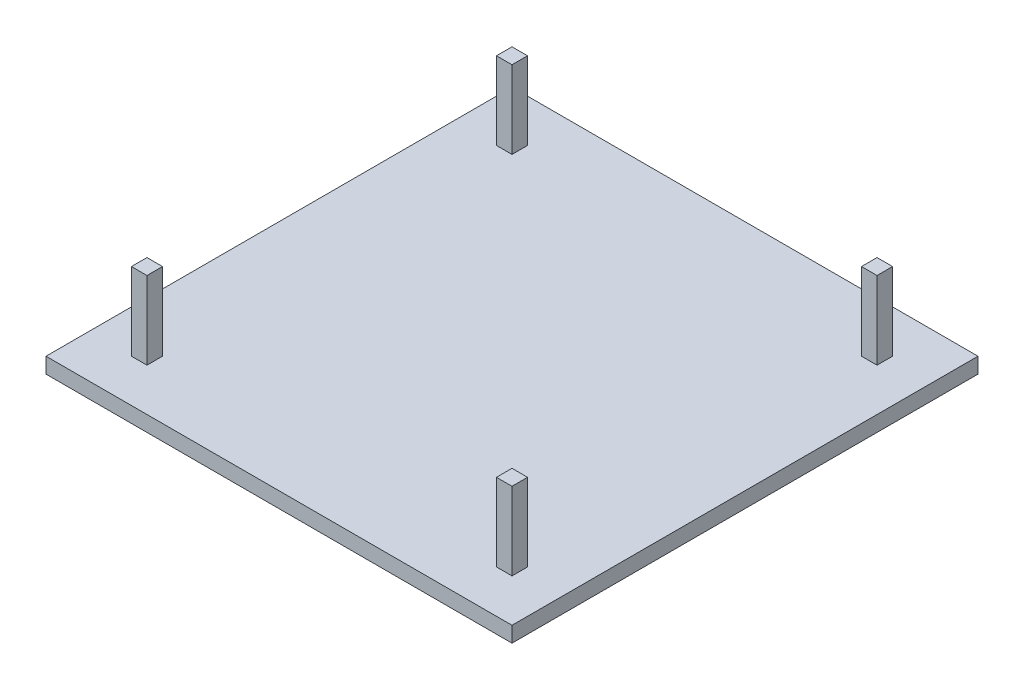
ISO-10303-21;
HEADER;
FILE_DESCRIPTION(('STEP AP214'),'2;1');
FILE_NAME('part.step','',(''),(''),'','','');
FILE_SCHEMA(('AUTOMOTIVE_DESIGN { 1 0 10303 214 1 1 1 1 }'));
ENDSEC;
DATA;
#1=APPLICATION_CONTEXT('core data for automotive mechanical design processes');
#2=APPLICATION_PROTOCOL_DEFINITION('international standard','automotive_design',2000,#1);
#3=PRODUCT_CONTEXT('',#1,'mechanical');
#4=PRODUCT('Part','Part','',(#3));
#5=PRODUCT_RELATED_PRODUCT_CATEGORY('part','',(#4));
#6=PRODUCT_DEFINITION_FORMATION('','',#4);
#7=PRODUCT_DEFINITION_CONTEXT('part definition',#1,'design');
#8=PRODUCT_DEFINITION('design','',#6,#7);
#9=PRODUCT_DEFINITION_SHAPE('','',#8);
#10=(LENGTH_UNIT() NAMED_UNIT(*) SI_UNIT(.MILLI.,.METRE.));
#11=(NAMED_UNIT(*) PLANE_ANGLE_UNIT() SI_UNIT($,.RADIAN.));
#12=(NAMED_UNIT(*) SI_UNIT($,.STERADIAN.) SOLID_ANGLE_UNIT());
#13=UNCERTAINTY_MEASURE_WITH_UNIT(LENGTH_MEASURE(1.E-05),#10,'distance_accuracy_value','');
#14=(GEOMETRIC_REPRESENTATION_CONTEXT(3) GLOBAL_UNCERTAINTY_ASSIGNED_CONTEXT((#13)) GLOBAL_UNIT_ASSIGNED_CONTEXT((#10,
#11,#12)) REPRESENTATION_CONTEXT('',''));
#15=CARTESIAN_POINT('',(0.,0.,0.));
#16=DIRECTION('',(0.,0.,1.));
#17=DIRECTION('',(1.,0.,0.));
#18=AXIS2_PLACEMENT_3D('',#15,#16,#17);
#19=CARTESIAN_POINT('',(0.,2.,0.));
#20=DIRECTION('',(0.,1.,0.));
#21=DIRECTION('',(0.,0.,1.));
#22=AXIS2_PLACEMENT_3D('',#19,#20,#21);
#23=PLANE('',#22);
#24=DIRECTION('',(0.,0.,1.));
#25=VECTOR('',#24,1.);
#26=CARTESIAN_POINT('',(-25.0673854447439,2.,-21.1590296495957));
#27=LINE('',#26,#25);
#28=CARTESIAN_POINT('',(-25.0673854447439,2.,-21.1590296495957));
#29=VERTEX_POINT('',#28);
#30=CARTESIAN_POINT('',(-25.0673854447439,2.,38.8409703504043));
#31=VERTEX_POINT('',#30);
#32=EDGE_CURVE('E290',#29,#31,#27,.T.);
#33=ORIENTED_EDGE('',*,*,#32,.T.);
#34=DIRECTION('',(1.,0.,0.));
#35=VECTOR('',#34,1.);
#36=CARTESIAN_POINT('',(-25.0673854447439,2.,38.8409703504043));
#37=LINE('',#36,#35);
#38=CARTESIAN_POINT('',(34.9326145552561,2.,38.8409703504043));
#39=VERTEX_POINT('',#38);
#40=EDGE_CURVE('E293',#31,#39,#37,.T.);
#41=ORIENTED_EDGE('',*,*,#40,.T.);
#42=DIRECTION('',(0.,0.,-1.));
#43=VECTOR('',#42,1.);
#44=CARTESIAN_POINT('',(34.9326145552561,2.,-21.1590296495957));
#45=LINE('',#44,#43);
#46=CARTESIAN_POINT('',(34.9326145552561,2.,-21.1590296495957));
#47=VERTEX_POINT('',#46);
#48=EDGE_CURVE('E296',#39,#47,#45,.T.);
#49=ORIENTED_EDGE('',*,*,#48,.T.);
#50=DIRECTION('',(-1.,0.,0.));
#51=VECTOR('',#50,1.);
#52=CARTESIAN_POINT('',(-25.0673854447439,2.,-21.1590296495957));
#53=LINE('',#52,#51);
#54=EDGE_CURVE('E298',#47,#29,#53,.T.);
#55=ORIENTED_EDGE('',*,*,#54,.T.);
#56=EDGE_LOOP('',(#33,#41,#49,#55));
#57=FACE_BOUND('',#56,.T.);
#58=DIRECTION('',(1.,0.,0.));
#59=VECTOR('',#58,1.);
#60=CARTESIAN_POINT('',(-19.5673854447439,2.,-13.6590296495957));
#61=LINE('',#60,#59);
#62=CARTESIAN_POINT('',(-19.5673854447439,2.,-13.6590296495957));
#63=VERTEX_POINT('',#62);
#64=CARTESIAN_POINT('',(-17.5673854447439,2.,-13.6590296495957));
#65=VERTEX_POINT('',#64);
#66=EDGE_CURVE('E274',#63,#65,#61,.T.);
#67=ORIENTED_EDGE('',*,*,#66,.F.);
#68=DIRECTION('',(0.,0.,1.));
#69=VECTOR('',#68,1.);
#70=CARTESIAN_POINT('',(-19.5673854447439,2.,-15.6590296495957));
#71=LINE('',#70,#69);
#72=CARTESIAN_POINT('',(-19.5673854447439,2.,-15.6590296495957));
#73=VERTEX_POINT('',#72);
#74=EDGE_CURVE('E260',#73,#63,#71,.T.);
#75=ORIENTED_EDGE('',*,*,#74,.F.);
#76=DIRECTION('',(-1.,0.,0.));
#77=VECTOR('',#76,1.);
#78=CARTESIAN_POINT('',(-19.5673854447439,2.,-15.6590296495957));
#79=LINE('',#78,#77);
#80=CARTESIAN_POINT('',(-17.5673854447439,2.,-15.6590296495957));
#81=VERTEX_POINT('',#80);
#82=EDGE_CURVE('E265',#81,#73,#79,.T.);
#83=ORIENTED_EDGE('',*,*,#82,.F.);
#84=DIRECTION('',(0.,0.,-1.));
#85=VECTOR('',#84,1.);
#86=CARTESIAN_POINT('',(-17.5673854447439,2.,-15.6590296495957));
#87=LINE('',#86,#85);
#88=EDGE_CURVE('E276',#65,#81,#87,.T.);
#89=ORIENTED_EDGE('',*,*,#88,.F.);
#90=EDGE_LOOP('',(#67,#75,#83,#89));
#91=FACE_BOUND('',#90,.T.);
#92=DIRECTION('',(0.,0.,1.));
#93=VECTOR('',#92,1.);
#94=CARTESIAN_POINT('',(27.4326145552561,2.,-15.6590296495957));
#95=LINE('',#94,#93);
#96=CARTESIAN_POINT('',(27.4326145552561,2.,-15.6590296495957));
#97=VERTEX_POINT('',#96);
#98=CARTESIAN_POINT('',(27.4326145552561,2.,-13.6590296495957));
#99=VERTEX_POINT('',#98);
#100=EDGE_CURVE('E245',#97,#99,#95,.T.);
#101=ORIENTED_EDGE('',*,*,#100,.F.);
#102=DIRECTION('',(-1.,0.,0.));
#103=VECTOR('',#102,1.);
#104=CARTESIAN_POINT('',(29.4326145552561,2.,-15.6590296495957));
#105=LINE('',#104,#103);
#106=CARTESIAN_POINT('',(29.4326145552561,2.,-15.6590296495957));
#107=VERTEX_POINT('',#106);
#108=EDGE_CURVE('E231',#107,#97,#105,.T.);
#109=ORIENTED_EDGE('',*,*,#108,.F.);
#110=DIRECTION('',(0.,0.,-1.));
#111=VECTOR('',#110,1.);
#112=CARTESIAN_POINT('',(29.4326145552561,2.,-15.6590296495957));
#113=LINE('',#112,#111);
#114=CARTESIAN_POINT('',(29.4326145552561,2.,-13.6590296495957));
#115=VERTEX_POINT('',#114);
#116=EDGE_CURVE('E236',#115,#107,#113,.T.);
#117=ORIENTED_EDGE('',*,*,#116,.F.);
#118=DIRECTION('',(1.,0.,0.));
#119=VECTOR('',#118,1.);
#120=CARTESIAN_POINT('',(29.4326145552561,2.,-13.6590296495957));
#121=LINE('',#120,#119);
#122=EDGE_CURVE('E247',#99,#115,#121,.T.);
#123=ORIENTED_EDGE('',*,*,#122,.F.);
#124=EDGE_LOOP('',(#101,#109,#117,#123));
#125=FACE_BOUND('',#124,.T.);
#126=DIRECTION('',(-1.,0.,0.));
#127=VECTOR('',#126,1.);
#128=CARTESIAN_POINT('',(29.4326145552561,2.,31.3409703504043));
#129=LINE('',#128,#127);
#130=CARTESIAN_POINT('',(29.4326145552561,2.,31.3409703504043));
#131=VERTEX_POINT('',#130);
#132=CARTESIAN_POINT('',(27.4326145552561,2.,31.3409703504043));
#133=VERTEX_POINT('',#132);
#134=EDGE_CURVE('E203',#131,#133,#129,.T.);
#135=ORIENTED_EDGE('',*,*,#134,.F.);
#136=DIRECTION('',(0.,0.,-1.));
#137=VECTOR('',#136,1.);
#138=CARTESIAN_POINT('',(29.4326145552561,2.,33.3409703504043));
#139=LINE('',#138,#137);
#140=CARTESIAN_POINT('',(29.4326145552561,2.,33.3409703504043));
#141=VERTEX_POINT('',#140);
#142=EDGE_CURVE('E200',#141,#131,#139,.T.);
#143=ORIENTED_EDGE('',*,*,#142,.F.);
#144=DIRECTION('',(1.,0.,0.));
#145=VECTOR('',#144,1.);
#146=CARTESIAN_POINT('',(29.4326145552561,2.,33.3409703504043));
#147=LINE('',#146,#145);
#148=CARTESIAN_POINT('',(27.4326145552561,2.,33.3409703504043));
#149=VERTEX_POINT('',#148);
#150=EDGE_CURVE('E212',#149,#141,#147,.T.);
#151=ORIENTED_EDGE('',*,*,#150,.F.);
#152=DIRECTION('',(0.,0.,1.));
#153=VECTOR('',#152,1.);
#154=CARTESIAN_POINT('',(27.4326145552561,2.,33.3409703504043));
#155=LINE('',#154,#153);
#156=EDGE_CURVE('E220',#133,#149,#155,.T.);
#157=ORIENTED_EDGE('',*,*,#156,.F.);
#158=EDGE_LOOP('',(#135,#143,#151,#157));
#159=FACE_BOUND('',#158,.T.);
#160=DIRECTION('',(0.,0.,-1.));
#161=VECTOR('',#160,1.);
#162=CARTESIAN_POINT('',(-17.5673854447439,2.,33.3409703504043));
#163=LINE('',#162,#161);
#164=CARTESIAN_POINT('',(-17.5673854447439,2.,33.3409703504043));
#165=VERTEX_POINT('',#164);
#166=CARTESIAN_POINT('',(-17.5673854447439,2.,31.3409703504043));
#167=VERTEX_POINT('',#166);
#168=EDGE_CURVE('E579',#165,#167,#163,.T.);
#169=ORIENTED_EDGE('',*,*,#168,.F.);
#170=DIRECTION('',(1.,0.,0.));
#171=VECTOR('',#170,1.);
#172=CARTESIAN_POINT('',(-19.5673854447439,2.,33.3409703504043));
#173=LINE('',#172,#171);
#174=CARTESIAN_POINT('',(-19.5673854447439,2.,33.3409703504043));
#175=VERTEX_POINT('',#174);
#176=EDGE_CURVE('E198',#175,#165,#173,.T.);
#177=ORIENTED_EDGE('',*,*,#176,.F.);
#178=DIRECTION('',(0.,0.,1.));
#179=VECTOR('',#178,1.);
#180=CARTESIAN_POINT('',(-19.5673854447439,2.,33.3409703504043));
#181=LINE('',#180,#179);
#182=CARTESIAN_POINT('',(-19.5673854447439,2.,31.3409703504043));
#183=VERTEX_POINT('',#182);
#184=EDGE_CURVE('E194',#183,#175,#181,.T.);
#185=ORIENTED_EDGE('',*,*,#184,.F.);
#186=DIRECTION('',(-1.,0.,0.));
#187=VECTOR('',#186,1.);
#188=CARTESIAN_POINT('',(-19.5673854447439,2.,31.3409703504043));
#189=LINE('',#188,#187);
#190=EDGE_CURVE('E576',#167,#183,#189,.T.);
#191=ORIENTED_EDGE('',*,*,#190,.F.);
#192=EDGE_LOOP('',(#169,#177,#185,#191));
#193=FACE_BOUND('',#192,.T.);
#194=ADVANCED_FACE('F37',(#57,#91,#125,#159,#193),#23,.T.);
#195=CARTESIAN_POINT('',(-25.0673854447439,2.,-21.1590296495957));
#196=DIRECTION('',(1.,0.,0.));
#197=DIRECTION('',(0.,0.,-1.));
#198=AXIS2_PLACEMENT_3D('',#195,#196,#197);
#199=PLANE('',#198);
#200=DIRECTION('',(0.,0.,1.));
#201=VECTOR('',#200,1.);
#202=CARTESIAN_POINT('',(-25.0673854447439,0.,-21.1590296495957));
#203=LINE('',#202,#201);
#204=CARTESIAN_POINT('',(-25.0673854447439,0.,-21.1590296495957));
#205=VERTEX_POINT('',#204);
#206=CARTESIAN_POINT('',(-25.0673854447439,0.,38.8409703504043));
#207=VERTEX_POINT('',#206);
#208=EDGE_CURVE('E289',#205,#207,#203,.T.);
#209=ORIENTED_EDGE('',*,*,#208,.T.);
#210=DIRECTION('',(0.,-1.,0.));
#211=VECTOR('',#210,1.);
#212=CARTESIAN_POINT('',(-25.0673854447439,2.,38.8409703504043));
#213=LINE('',#212,#211);
#214=EDGE_CURVE('E11',#31,#207,#213,.T.);
#215=ORIENTED_EDGE('',*,*,#214,.F.);
#216=ORIENTED_EDGE('',*,*,#32,.F.);
#217=DIRECTION('',(0.,-1.,0.));
#218=VECTOR('',#217,1.);
#219=CARTESIAN_POINT('',(-25.0673854447439,2.,-21.1590296495957));
#220=LINE('',#219,#218);
#221=EDGE_CURVE('E300',#29,#205,#220,.T.);
#222=ORIENTED_EDGE('',*,*,#221,.T.);
#223=EDGE_LOOP('',(#209,#215,#216,#222));
#224=FACE_BOUND('',#223,.T.);
#225=ADVANCED_FACE('F39',(#224),#199,.F.);
#226=CARTESIAN_POINT('',(-25.0673854447439,2.,38.8409703504043));
#227=DIRECTION('',(0.,0.,-1.));
#228=DIRECTION('',(-1.,0.,0.));
#229=AXIS2_PLACEMENT_3D('',#226,#227,#228);
#230=PLANE('',#229);
#231=DIRECTION('',(1.,0.,0.));
#232=VECTOR('',#231,1.);
#233=CARTESIAN_POINT('',(-25.0673854447439,0.,38.8409703504043));
#234=LINE('',#233,#232);
#235=CARTESIAN_POINT('',(34.9326145552561,0.,38.8409703504043));
#236=VERTEX_POINT('',#235);
#237=EDGE_CURVE('E303',#207,#236,#234,.T.);
#238=ORIENTED_EDGE('',*,*,#237,.T.);
#239=DIRECTION('',(0.,-1.,0.));
#240=VECTOR('',#239,1.);
#241=CARTESIAN_POINT('',(34.9326145552561,2.,38.8409703504043));
#242=LINE('',#241,#240);
#243=EDGE_CURVE('E45',#39,#236,#242,.T.);
#244=ORIENTED_EDGE('',*,*,#243,.F.);
#245=ORIENTED_EDGE('',*,*,#40,.F.);
#246=ORIENTED_EDGE('',*,*,#214,.T.);
#247=EDGE_LOOP('',(#238,#244,#245,#246));
#248=FACE_BOUND('',#247,.T.);
#249=ADVANCED_FACE('F333',(#248),#230,.F.);
#250=CARTESIAN_POINT('',(34.9326145552561,2.,-21.1590296495957));
#251=DIRECTION('',(-1.,0.,0.));
#252=DIRECTION('',(0.,0.,1.));
#253=AXIS2_PLACEMENT_3D('',#250,#251,#252);
#254=PLANE('',#253);
#255=DIRECTION('',(0.,0.,-1.));
#256=VECTOR('',#255,1.);
#257=CARTESIAN_POINT('',(34.9326145552561,0.,-21.1590296495957));
#258=LINE('',#257,#256);
#259=CARTESIAN_POINT('',(34.9326145552561,0.,-21.1590296495957));
#260=VERTEX_POINT('',#259);
#261=EDGE_CURVE('E305',#236,#260,#258,.T.);
#262=ORIENTED_EDGE('',*,*,#261,.T.);
#263=DIRECTION('',(0.,-1.,0.));
#264=VECTOR('',#263,1.);
#265=CARTESIAN_POINT('',(34.9326145552561,2.,-21.1590296495957));
#266=LINE('',#265,#264);
#267=EDGE_CURVE('E310',#47,#260,#266,.T.);
#268=ORIENTED_EDGE('',*,*,#267,.F.);
#269=ORIENTED_EDGE('',*,*,#48,.F.);
#270=ORIENTED_EDGE('',*,*,#243,.T.);
#271=EDGE_LOOP('',(#262,#268,#269,#270));
#272=FACE_BOUND('',#271,.T.);
#273=ADVANCED_FACE('F317',(#272),#254,.F.);
#274=CARTESIAN_POINT('',(-25.0673854447439,2.,-21.1590296495957));
#275=DIRECTION('',(0.,0.,1.));
#276=DIRECTION('',(1.,0.,0.));
#277=AXIS2_PLACEMENT_3D('',#274,#275,#276);
#278=PLANE('',#277);
#279=DIRECTION('',(-1.,0.,0.));
#280=VECTOR('',#279,1.);
#281=CARTESIAN_POINT('',(-25.0673854447439,0.,-21.1590296495957));
#282=LINE('',#281,#280);
#283=EDGE_CURVE('E294',#260,#205,#282,.T.);
#284=ORIENTED_EDGE('',*,*,#283,.T.);
#285=ORIENTED_EDGE('',*,*,#221,.F.);
#286=ORIENTED_EDGE('',*,*,#54,.F.);
#287=ORIENTED_EDGE('',*,*,#267,.T.);
#288=EDGE_LOOP('',(#284,#285,#286,#287));
#289=FACE_BOUND('',#288,.T.);
#290=ADVANCED_FACE('F326',(#289),#278,.F.);
#291=CARTESIAN_POINT('',(0.,0.,0.));
#292=DIRECTION('',(0.,1.,0.));
#293=DIRECTION('',(0.,0.,1.));
#294=AXIS2_PLACEMENT_3D('',#291,#292,#293);
#295=PLANE('',#294);
#296=ORIENTED_EDGE('',*,*,#208,.F.);
#297=ORIENTED_EDGE('',*,*,#283,.F.);
#298=ORIENTED_EDGE('',*,*,#261,.F.);
#299=ORIENTED_EDGE('',*,*,#237,.F.);
#300=EDGE_LOOP('',(#296,#297,#298,#299));
#301=FACE_BOUND('',#300,.T.);
#302=ADVANCED_FACE('F323',(#301),#295,.F.);
#303=CARTESIAN_POINT('',(-19.5673854447439,12.,-15.6590296495957));
#304=DIRECTION('',(1.,0.,0.));
#305=DIRECTION('',(0.,0.,-1.));
#306=AXIS2_PLACEMENT_3D('',#303,#304,#305);
#307=PLANE('',#306);
#308=ORIENTED_EDGE('',*,*,#74,.T.);
#309=DIRECTION('',(0.,-1.,0.));
#310=VECTOR('',#309,1.);
#311=CARTESIAN_POINT('',(-19.5673854447439,12.,-13.6590296495957));
#312=LINE('',#311,#310);
#313=CARTESIAN_POINT('',(-19.5673854447439,12.,-13.6590296495957));
#314=VERTEX_POINT('',#313);
#315=EDGE_CURVE('E287',#314,#63,#312,.T.);
#316=ORIENTED_EDGE('',*,*,#315,.F.);
#317=DIRECTION('',(0.,0.,1.));
#318=VECTOR('',#317,1.);
#319=CARTESIAN_POINT('',(-19.5673854447439,12.,-15.6590296495957));
#320=LINE('',#319,#318);
#321=CARTESIAN_POINT('',(-19.5673854447439,12.,-15.6590296495957));
#322=VERTEX_POINT('',#321);
#323=EDGE_CURVE('E261',#322,#314,#320,.T.);
#324=ORIENTED_EDGE('',*,*,#323,.F.);
#325=DIRECTION('',(0.,-1.,0.));
#326=VECTOR('',#325,1.);
#327=CARTESIAN_POINT('',(-19.5673854447439,12.,-15.6590296495957));
#328=LINE('',#327,#326);
#329=EDGE_CURVE('E271',#322,#73,#328,.T.);
#330=ORIENTED_EDGE('',*,*,#329,.T.);
#331=EDGE_LOOP('',(#308,#316,#324,#330));
#332=FACE_BOUND('',#331,.T.);
#333=ADVANCED_FACE('F346',(#332),#307,.F.);
#334=CARTESIAN_POINT('',(-19.5673854447439,12.,-13.6590296495957));
#335=DIRECTION('',(0.,0.,-1.));
#336=DIRECTION('',(-1.,0.,0.));
#337=AXIS2_PLACEMENT_3D('',#334,#335,#336);
#338=PLANE('',#337);
#339=ORIENTED_EDGE('',*,*,#66,.T.);
#340=DIRECTION('',(0.,-1.,0.));
#341=VECTOR('',#340,1.);
#342=CARTESIAN_POINT('',(-17.5673854447439,12.,-13.6590296495957));
#343=LINE('',#342,#341);
#344=CARTESIAN_POINT('',(-17.5673854447439,12.,-13.6590296495957));
#345=VERTEX_POINT('',#344);
#346=EDGE_CURVE('E284',#345,#65,#343,.T.);
#347=ORIENTED_EDGE('',*,*,#346,.F.);
#348=DIRECTION('',(1.,0.,0.));
#349=VECTOR('',#348,1.);
#350=CARTESIAN_POINT('',(-19.5673854447439,12.,-13.6590296495957));
#351=LINE('',#350,#349);
#352=EDGE_CURVE('E264',#314,#345,#351,.T.);
#353=ORIENTED_EDGE('',*,*,#352,.F.);
#354=ORIENTED_EDGE('',*,*,#315,.T.);
#355=EDGE_LOOP('',(#339,#347,#353,#354));
#356=FACE_BOUND('',#355,.T.);
#357=ADVANCED_FACE('F365',(#356),#338,.F.);
#358=CARTESIAN_POINT('',(-17.5673854447439,12.,-15.6590296495957));
#359=DIRECTION('',(-1.,0.,0.));
#360=DIRECTION('',(0.,0.,1.));
#361=AXIS2_PLACEMENT_3D('',#358,#359,#360);
#362=PLANE('',#361);
#363=ORIENTED_EDGE('',*,*,#88,.T.);
#364=DIRECTION('',(0.,-1.,0.));
#365=VECTOR('',#364,1.);
#366=CARTESIAN_POINT('',(-17.5673854447439,12.,-15.6590296495957));
#367=LINE('',#366,#365);
#368=CARTESIAN_POINT('',(-17.5673854447439,12.,-15.6590296495957));
#369=VERTEX_POINT('',#368);
#370=EDGE_CURVE('E282',#369,#81,#367,.T.);
#371=ORIENTED_EDGE('',*,*,#370,.F.);
#372=DIRECTION('',(0.,0.,-1.));
#373=VECTOR('',#372,1.);
#374=CARTESIAN_POINT('',(-17.5673854447439,12.,-15.6590296495957));
#375=LINE('',#374,#373);
#376=EDGE_CURVE('E267',#345,#369,#375,.T.);
#377=ORIENTED_EDGE('',*,*,#376,.F.);
#378=ORIENTED_EDGE('',*,*,#346,.T.);
#379=EDGE_LOOP('',(#363,#371,#377,#378));
#380=FACE_BOUND('',#379,.T.);
#381=ADVANCED_FACE('F372',(#380),#362,.F.);
#382=CARTESIAN_POINT('',(-19.5673854447439,12.,-15.6590296495957));
#383=DIRECTION('',(0.,0.,1.));
#384=DIRECTION('',(1.,0.,0.));
#385=AXIS2_PLACEMENT_3D('',#382,#383,#384);
#386=PLANE('',#385);
#387=ORIENTED_EDGE('',*,*,#82,.T.);
#388=ORIENTED_EDGE('',*,*,#329,.F.);
#389=DIRECTION('',(-1.,0.,0.));
#390=VECTOR('',#389,1.);
#391=CARTESIAN_POINT('',(-19.5673854447439,12.,-15.6590296495957));
#392=LINE('',#391,#390);
#393=EDGE_CURVE('E269',#369,#322,#392,.T.);
#394=ORIENTED_EDGE('',*,*,#393,.F.);
#395=ORIENTED_EDGE('',*,*,#370,.T.);
#396=EDGE_LOOP('',(#387,#388,#394,#395));
#397=FACE_BOUND('',#396,.T.);
#398=ADVANCED_FACE('F379',(#397),#386,.F.);
#399=CARTESIAN_POINT('',(0.,12.,0.));
#400=DIRECTION('',(0.,1.,0.));
#401=DIRECTION('',(0.,0.,1.));
#402=AXIS2_PLACEMENT_3D('',#399,#400,#401);
#403=PLANE('',#402);
#404=ORIENTED_EDGE('',*,*,#323,.T.);
#405=ORIENTED_EDGE('',*,*,#352,.T.);
#406=ORIENTED_EDGE('',*,*,#376,.T.);
#407=ORIENTED_EDGE('',*,*,#393,.T.);
#408=EDGE_LOOP('',(#404,#405,#406,#407));
#409=FACE_BOUND('',#408,.T.);
#410=ADVANCED_FACE('F387',(#409),#403,.T.);
#411=CARTESIAN_POINT('',(29.4326145552561,12.,-15.6590296495957));
#412=DIRECTION('',(0.,0.,1.));
#413=DIRECTION('',(1.,0.,0.));
#414=AXIS2_PLACEMENT_3D('',#411,#412,#413);
#415=PLANE('',#414);
#416=ORIENTED_EDGE('',*,*,#108,.T.);
#417=DIRECTION('',(0.,-1.,0.));
#418=VECTOR('',#417,1.);
#419=CARTESIAN_POINT('',(27.4326145552561,12.,-15.6590296495957));
#420=LINE('',#419,#418);
#421=CARTESIAN_POINT('',(27.4326145552561,12.,-15.6590296495957));
#422=VERTEX_POINT('',#421);
#423=EDGE_CURVE('E258',#422,#97,#420,.T.);
#424=ORIENTED_EDGE('',*,*,#423,.F.);
#425=DIRECTION('',(-1.,0.,0.));
#426=VECTOR('',#425,1.);
#427=CARTESIAN_POINT('',(29.4326145552561,12.,-15.6590296495957));
#428=LINE('',#427,#426);
#429=CARTESIAN_POINT('',(29.4326145552561,12.,-15.6590296495957));
#430=VERTEX_POINT('',#429);
#431=EDGE_CURVE('E232',#430,#422,#428,.T.);
#432=ORIENTED_EDGE('',*,*,#431,.F.);
#433=DIRECTION('',(0.,-1.,0.));
#434=VECTOR('',#433,1.);
#435=CARTESIAN_POINT('',(29.4326145552561,12.,-15.6590296495957));
#436=LINE('',#435,#434);
#437=EDGE_CURVE('E242',#430,#107,#436,.T.);
#438=ORIENTED_EDGE('',*,*,#437,.T.);
#439=EDGE_LOOP('',(#416,#424,#432,#438));
#440=FACE_BOUND('',#439,.T.);
#441=ADVANCED_FACE('F395',(#440),#415,.F.);
#442=CARTESIAN_POINT('',(27.4326145552561,12.,-15.6590296495957));
#443=DIRECTION('',(1.,0.,0.));
#444=DIRECTION('',(0.,0.,-1.));
#445=AXIS2_PLACEMENT_3D('',#442,#443,#444);
#446=PLANE('',#445);
#447=ORIENTED_EDGE('',*,*,#100,.T.);
#448=DIRECTION('',(0.,-1.,0.));
#449=VECTOR('',#448,1.);
#450=CARTESIAN_POINT('',(27.4326145552561,12.,-13.6590296495957));
#451=LINE('',#450,#449);
#452=CARTESIAN_POINT('',(27.4326145552561,12.,-13.6590296495957));
#453=VERTEX_POINT('',#452);
#454=EDGE_CURVE('E255',#453,#99,#451,.T.);
#455=ORIENTED_EDGE('',*,*,#454,.F.);
#456=DIRECTION('',(0.,0.,1.));
#457=VECTOR('',#456,1.);
#458=CARTESIAN_POINT('',(27.4326145552561,12.,-15.6590296495957));
#459=LINE('',#458,#457);
#460=EDGE_CURVE('E235',#422,#453,#459,.T.);
#461=ORIENTED_EDGE('',*,*,#460,.F.);
#462=ORIENTED_EDGE('',*,*,#423,.T.);
#463=EDGE_LOOP('',(#447,#455,#461,#462));
#464=FACE_BOUND('',#463,.T.);
#465=ADVANCED_FACE('F403',(#464),#446,.F.);
#466=CARTESIAN_POINT('',(29.4326145552561,12.,-13.6590296495957));
#467=DIRECTION('',(0.,0.,-1.));
#468=DIRECTION('',(-1.,0.,0.));
#469=AXIS2_PLACEMENT_3D('',#466,#467,#468);
#470=PLANE('',#469);
#471=ORIENTED_EDGE('',*,*,#122,.T.);
#472=DIRECTION('',(0.,-1.,0.));
#473=VECTOR('',#472,1.);
#474=CARTESIAN_POINT('',(29.4326145552561,12.,-13.6590296495957));
#475=LINE('',#474,#473);
#476=CARTESIAN_POINT('',(29.4326145552561,12.,-13.6590296495957));
#477=VERTEX_POINT('',#476);
#478=EDGE_CURVE('E253',#477,#115,#475,.T.);
#479=ORIENTED_EDGE('',*,*,#478,.F.);
#480=DIRECTION('',(1.,0.,0.));
#481=VECTOR('',#480,1.);
#482=CARTESIAN_POINT('',(29.4326145552561,12.,-13.6590296495957));
#483=LINE('',#482,#481);
#484=EDGE_CURVE('E238',#453,#477,#483,.T.);
#485=ORIENTED_EDGE('',*,*,#484,.F.);
#486=ORIENTED_EDGE('',*,*,#454,.T.);
#487=EDGE_LOOP('',(#471,#479,#485,#486));
#488=FACE_BOUND('',#487,.T.);
#489=ADVANCED_FACE('F411',(#488),#470,.F.);
#490=CARTESIAN_POINT('',(29.4326145552561,12.,-15.6590296495957));
#491=DIRECTION('',(-1.,0.,0.));
#492=DIRECTION('',(0.,0.,1.));
#493=AXIS2_PLACEMENT_3D('',#490,#491,#492);
#494=PLANE('',#493);
#495=ORIENTED_EDGE('',*,*,#116,.T.);
#496=ORIENTED_EDGE('',*,*,#437,.F.);
#497=DIRECTION('',(0.,0.,-1.));
#498=VECTOR('',#497,1.);
#499=CARTESIAN_POINT('',(29.4326145552561,12.,-15.6590296495957));
#500=LINE('',#499,#498);
#501=EDGE_CURVE('E240',#477,#430,#500,.T.);
#502=ORIENTED_EDGE('',*,*,#501,.F.);
#503=ORIENTED_EDGE('',*,*,#478,.T.);
#504=EDGE_LOOP('',(#495,#496,#502,#503));
#505=FACE_BOUND('',#504,.T.);
#506=ADVANCED_FACE('F419',(#505),#494,.F.);
#507=CARTESIAN_POINT('',(0.,12.,0.));
#508=DIRECTION('',(0.,1.,0.));
#509=DIRECTION('',(0.,0.,1.));
#510=AXIS2_PLACEMENT_3D('',#507,#508,#509);
#511=PLANE('',#510);
#512=ORIENTED_EDGE('',*,*,#431,.T.);
#513=ORIENTED_EDGE('',*,*,#460,.T.);
#514=ORIENTED_EDGE('',*,*,#484,.T.);
#515=ORIENTED_EDGE('',*,*,#501,.T.);
#516=EDGE_LOOP('',(#512,#513,#514,#515));
#517=FACE_BOUND('',#516,.T.);
#518=ADVANCED_FACE('F427',(#517),#511,.T.);
#519=CARTESIAN_POINT('',(29.4326145552561,12.,33.3409703504043));
#520=DIRECTION('',(-1.,0.,0.));
#521=DIRECTION('',(0.,0.,1.));
#522=AXIS2_PLACEMENT_3D('',#519,#520,#521);
#523=PLANE('',#522);
#524=ORIENTED_EDGE('',*,*,#142,.T.);
#525=DIRECTION('',(0.,-1.,0.));
#526=VECTOR('',#525,1.);
#527=CARTESIAN_POINT('',(29.4326145552561,12.,31.3409703504043));
#528=LINE('',#527,#526);
#529=CARTESIAN_POINT('',(29.4326145552561,12.,31.3409703504043));
#530=VERTEX_POINT('',#529);
#531=EDGE_CURVE('E229',#530,#131,#528,.T.);
#532=ORIENTED_EDGE('',*,*,#531,.F.);
#533=DIRECTION('',(0.,0.,-1.));
#534=VECTOR('',#533,1.);
#535=CARTESIAN_POINT('',(29.4326145552561,12.,33.3409703504043));
#536=LINE('',#535,#534);
#537=CARTESIAN_POINT('',(29.4326145552561,12.,33.3409703504043));
#538=VERTEX_POINT('',#537);
#539=EDGE_CURVE('E208',#538,#530,#536,.T.);
#540=ORIENTED_EDGE('',*,*,#539,.F.);
#541=DIRECTION('',(0.,-1.,0.));
#542=VECTOR('',#541,1.);
#543=CARTESIAN_POINT('',(29.4326145552561,12.,33.3409703504043));
#544=LINE('',#543,#542);
#545=EDGE_CURVE('E217',#538,#141,#544,.T.);
#546=ORIENTED_EDGE('',*,*,#545,.T.);
#547=EDGE_LOOP('',(#524,#532,#540,#546));
#548=FACE_BOUND('',#547,.T.);
#549=ADVANCED_FACE('F435',(#548),#523,.F.);
#550=CARTESIAN_POINT('',(29.4326145552561,12.,31.3409703504043));
#551=DIRECTION('',(0.,0.,1.));
#552=DIRECTION('',(1.,0.,0.));
#553=AXIS2_PLACEMENT_3D('',#550,#551,#552);
#554=PLANE('',#553);
#555=ORIENTED_EDGE('',*,*,#134,.T.);
#556=DIRECTION('',(0.,-1.,0.));
#557=VECTOR('',#556,1.);
#558=CARTESIAN_POINT('',(27.4326145552561,12.,31.3409703504043));
#559=LINE('',#558,#557);
#560=CARTESIAN_POINT('',(27.4326145552561,12.,31.3409703504043));
#561=VERTEX_POINT('',#560);
#562=EDGE_CURVE('E226',#561,#133,#559,.T.);
#563=ORIENTED_EDGE('',*,*,#562,.F.);
#564=DIRECTION('',(-1.,0.,0.));
#565=VECTOR('',#564,1.);
#566=CARTESIAN_POINT('',(29.4326145552561,12.,31.3409703504043));
#567=LINE('',#566,#565);
#568=EDGE_CURVE('E211',#530,#561,#567,.T.);
#569=ORIENTED_EDGE('',*,*,#568,.F.);
#570=ORIENTED_EDGE('',*,*,#531,.T.);
#571=EDGE_LOOP('',(#555,#563,#569,#570));
#572=FACE_BOUND('',#571,.T.);
#573=ADVANCED_FACE('F443',(#572),#554,.F.);
#574=CARTESIAN_POINT('',(27.4326145552561,12.,33.3409703504043));
#575=DIRECTION('',(1.,0.,0.));
#576=DIRECTION('',(0.,0.,-1.));
#577=AXIS2_PLACEMENT_3D('',#574,#575,#576);
#578=PLANE('',#577);
#579=ORIENTED_EDGE('',*,*,#156,.T.);
#580=DIRECTION('',(0.,-1.,0.));
#581=VECTOR('',#580,1.);
#582=CARTESIAN_POINT('',(27.4326145552561,12.,33.3409703504043));
#583=LINE('',#582,#581);
#584=CARTESIAN_POINT('',(27.4326145552561,12.,33.3409703504043));
#585=VERTEX_POINT('',#584);
#586=EDGE_CURVE('E60',#585,#149,#583,.T.);
#587=ORIENTED_EDGE('',*,*,#586,.F.);
#588=DIRECTION('',(0.,0.,1.));
#589=VECTOR('',#588,1.);
#590=CARTESIAN_POINT('',(27.4326145552561,12.,33.3409703504043));
#591=LINE('',#590,#589);
#592=EDGE_CURVE('E214',#561,#585,#591,.T.);
#593=ORIENTED_EDGE('',*,*,#592,.F.);
#594=ORIENTED_EDGE('',*,*,#562,.T.);
#595=EDGE_LOOP('',(#579,#587,#593,#594));
#596=FACE_BOUND('',#595,.T.);
#597=ADVANCED_FACE('F451',(#596),#578,.F.);
#598=CARTESIAN_POINT('',(29.4326145552561,12.,33.3409703504043));
#599=DIRECTION('',(0.,0.,-1.));
#600=DIRECTION('',(-1.,0.,0.));
#601=AXIS2_PLACEMENT_3D('',#598,#599,#600);
#602=PLANE('',#601);
#603=ORIENTED_EDGE('',*,*,#150,.T.);
#604=ORIENTED_EDGE('',*,*,#545,.F.);
#605=DIRECTION('',(1.,0.,0.));
#606=VECTOR('',#605,1.);
#607=CARTESIAN_POINT('',(29.4326145552561,12.,33.3409703504043));
#608=LINE('',#607,#606);
#609=EDGE_CURVE('E216',#585,#538,#608,.T.);
#610=ORIENTED_EDGE('',*,*,#609,.F.);
#611=ORIENTED_EDGE('',*,*,#586,.T.);
#612=EDGE_LOOP('',(#603,#604,#610,#611));
#613=FACE_BOUND('',#612,.T.);
#614=ADVANCED_FACE('F459',(#613),#602,.F.);
#615=CARTESIAN_POINT('',(0.,12.,0.));
#616=DIRECTION('',(0.,1.,0.));
#617=DIRECTION('',(0.,0.,1.));
#618=AXIS2_PLACEMENT_3D('',#615,#616,#617);
#619=PLANE('',#618);
#620=ORIENTED_EDGE('',*,*,#539,.T.);
#621=ORIENTED_EDGE('',*,*,#568,.T.);
#622=ORIENTED_EDGE('',*,*,#592,.T.);
#623=ORIENTED_EDGE('',*,*,#609,.T.);
#624=EDGE_LOOP('',(#620,#621,#622,#623));
#625=FACE_BOUND('',#624,.T.);
#626=ADVANCED_FACE('F467',(#625),#619,.T.);
#627=CARTESIAN_POINT('',(-19.5673854447439,12.,33.3409703504043));
#628=DIRECTION('',(0.,0.,-1.));
#629=DIRECTION('',(-1.,0.,0.));
#630=AXIS2_PLACEMENT_3D('',#627,#628,#629);
#631=PLANE('',#630);
#632=ORIENTED_EDGE('',*,*,#176,.T.);
#633=DIRECTION('',(0.,-1.,0.));
#634=VECTOR('',#633,1.);
#635=CARTESIAN_POINT('',(-17.5673854447439,12.,33.3409703504043));
#636=LINE('',#635,#634);
#637=CARTESIAN_POINT('',(-17.5673854447439,12.,33.3409703504043));
#638=VERTEX_POINT('',#637);
#639=EDGE_CURVE('E179',#638,#165,#636,.T.);
#640=ORIENTED_EDGE('',*,*,#639,.F.);
#641=DIRECTION('',(1.,0.,0.));
#642=VECTOR('',#641,1.);
#643=CARTESIAN_POINT('',(-19.5673854447439,12.,33.3409703504043));
#644=LINE('',#643,#642);
#645=CARTESIAN_POINT('',(-19.5673854447439,12.,33.3409703504043));
#646=VERTEX_POINT('',#645);
#647=EDGE_CURVE('E186',#646,#638,#644,.T.);
#648=ORIENTED_EDGE('',*,*,#647,.F.);
#649=DIRECTION('',(0.,-1.,0.));
#650=VECTOR('',#649,1.);
#651=CARTESIAN_POINT('',(-19.5673854447439,12.,33.3409703504043));
#652=LINE('',#651,#650);
#653=EDGE_CURVE('E573',#646,#175,#652,.T.);
#654=ORIENTED_EDGE('',*,*,#653,.T.);
#655=EDGE_LOOP('',(#632,#640,#648,#654));
#656=FACE_BOUND('',#655,.T.);
#657=ADVANCED_FACE('F196',(#656),#631,.F.);
#658=CARTESIAN_POINT('',(-17.5673854447439,12.,33.3409703504043));
#659=DIRECTION('',(-1.,0.,0.));
#660=DIRECTION('',(0.,0.,1.));
#661=AXIS2_PLACEMENT_3D('',#658,#659,#660);
#662=PLANE('',#661);
#663=ORIENTED_EDGE('',*,*,#168,.T.);
#664=DIRECTION('',(0.,-1.,0.));
#665=VECTOR('',#664,1.);
#666=CARTESIAN_POINT('',(-17.5673854447439,12.,31.3409703504043));
#667=LINE('',#666,#665);
#668=CARTESIAN_POINT('',(-17.5673854447439,12.,31.3409703504043));
#669=VERTEX_POINT('',#668);
#670=EDGE_CURVE('E182',#669,#167,#667,.T.);
#671=ORIENTED_EDGE('',*,*,#670,.F.);
#672=DIRECTION('',(0.,0.,-1.));
#673=VECTOR('',#672,1.);
#674=CARTESIAN_POINT('',(-17.5673854447439,12.,33.3409703504043));
#675=LINE('',#674,#673);
#676=EDGE_CURVE('E175',#638,#669,#675,.T.);
#677=ORIENTED_EDGE('',*,*,#676,.F.);
#678=ORIENTED_EDGE('',*,*,#639,.T.);
#679=EDGE_LOOP('',(#663,#671,#677,#678));
#680=FACE_BOUND('',#679,.T.);
#681=ADVANCED_FACE('F177',(#680),#662,.F.);
#682=CARTESIAN_POINT('',(-19.5673854447439,12.,31.3409703504043));
#683=DIRECTION('',(0.,0.,1.));
#684=DIRECTION('',(1.,0.,0.));
#685=AXIS2_PLACEMENT_3D('',#682,#683,#684);
#686=PLANE('',#685);
#687=ORIENTED_EDGE('',*,*,#190,.T.);
#688=DIRECTION('',(0.,-1.,0.));
#689=VECTOR('',#688,1.);
#690=CARTESIAN_POINT('',(-19.5673854447439,12.,31.3409703504043));
#691=LINE('',#690,#689);
#692=CARTESIAN_POINT('',(-19.5673854447439,12.,31.3409703504043));
#693=VERTEX_POINT('',#692);
#694=EDGE_CURVE('E52',#693,#183,#691,.T.);
#695=ORIENTED_EDGE('',*,*,#694,.F.);
#696=DIRECTION('',(-1.,0.,0.));
#697=VECTOR('',#696,1.);
#698=CARTESIAN_POINT('',(-19.5673854447439,12.,31.3409703504043));
#699=LINE('',#698,#697);
#700=EDGE_CURVE('E185',#669,#693,#699,.T.);
#701=ORIENTED_EDGE('',*,*,#700,.F.);
#702=ORIENTED_EDGE('',*,*,#670,.T.);
#703=EDGE_LOOP('',(#687,#695,#701,#702));
#704=FACE_BOUND('',#703,.T.);
#705=ADVANCED_FACE('F487',(#704),#686,.F.);
#706=CARTESIAN_POINT('',(-19.5673854447439,12.,33.3409703504043));
#707=DIRECTION('',(1.,0.,0.));
#708=DIRECTION('',(0.,0.,-1.));
#709=AXIS2_PLACEMENT_3D('',#706,#707,#708);
#710=PLANE('',#709);
#711=ORIENTED_EDGE('',*,*,#184,.T.);
#712=ORIENTED_EDGE('',*,*,#653,.F.);
#713=DIRECTION('',(0.,0.,1.));
#714=VECTOR('',#713,1.);
#715=CARTESIAN_POINT('',(-19.5673854447439,12.,33.3409703504043));
#716=LINE('',#715,#714);
#717=EDGE_CURVE('E190',#693,#646,#716,.T.);
#718=ORIENTED_EDGE('',*,*,#717,.F.);
#719=ORIENTED_EDGE('',*,*,#694,.T.);
#720=EDGE_LOOP('',(#711,#712,#718,#719));
#721=FACE_BOUND('',#720,.T.);
#722=ADVANCED_FACE('F494',(#721),#710,.F.);
#723=CARTESIAN_POINT('',(0.,12.,0.));
#724=DIRECTION('',(0.,1.,0.));
#725=DIRECTION('',(0.,0.,1.));
#726=AXIS2_PLACEMENT_3D('',#723,#724,#725);
#727=PLANE('',#726);
#728=ORIENTED_EDGE('',*,*,#647,.T.);
#729=ORIENTED_EDGE('',*,*,#676,.T.);
#730=ORIENTED_EDGE('',*,*,#700,.T.);
#731=ORIENTED_EDGE('',*,*,#717,.T.);
#732=EDGE_LOOP('',(#728,#729,#730,#731));
#733=FACE_BOUND('',#732,.T.);
#734=ADVANCED_FACE('F189',(#733),#727,.T.);
#735=CLOSED_SHELL('',(#194,#225,#249,#273,#290,#302,#333,#357,#381,#398,#410,#441,#465,#489,
#506,#518,#549,#573,#597,#614,#626,#657,#681,#705,#722,#734));
#736=MANIFOLD_SOLID_BREP('B2',#735);
#737=ADVANCED_BREP_SHAPE_REPRESENTATION('',(#18,#736),#14);
#738=SHAPE_DEFINITION_REPRESENTATION(#9,#737);
ENDSEC;
END-ISO-10303-21;
